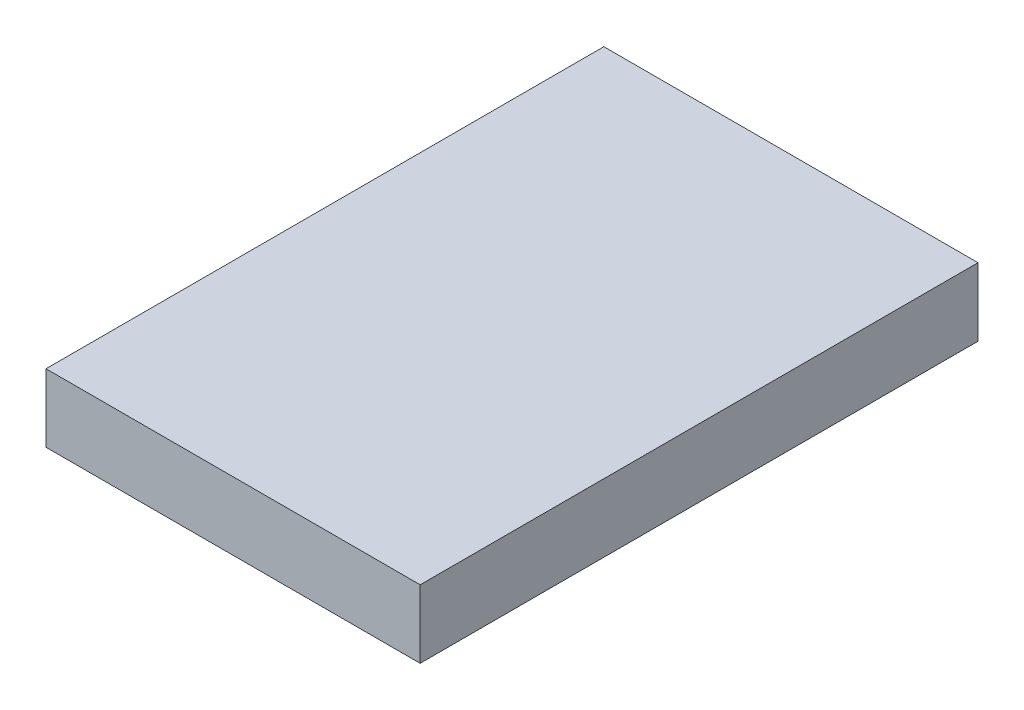
ISO-10303-21;
HEADER;
FILE_DESCRIPTION(('STEP AP214'),'2;1');
FILE_NAME('part.step','',(''),(''),'','','');
FILE_SCHEMA(('AUTOMOTIVE_DESIGN { 1 0 10303 214 1 1 1 1 }'));
ENDSEC;
DATA;
#1=APPLICATION_CONTEXT('core data for automotive mechanical design processes');
#2=APPLICATION_PROTOCOL_DEFINITION('international standard','automotive_design',2000,#1);
#3=PRODUCT_CONTEXT('',#1,'mechanical');
#4=PRODUCT('Part','Part','',(#3));
#5=PRODUCT_RELATED_PRODUCT_CATEGORY('part','',(#4));
#6=PRODUCT_DEFINITION_FORMATION('','',#4);
#7=PRODUCT_DEFINITION_CONTEXT('part definition',#1,'design');
#8=PRODUCT_DEFINITION('design','',#6,#7);
#9=PRODUCT_DEFINITION_SHAPE('','',#8);
#10=(LENGTH_UNIT() NAMED_UNIT(*) SI_UNIT(.MILLI.,.METRE.));
#11=(NAMED_UNIT(*) PLANE_ANGLE_UNIT() SI_UNIT($,.RADIAN.));
#12=(NAMED_UNIT(*) SI_UNIT($,.STERADIAN.) SOLID_ANGLE_UNIT());
#13=UNCERTAINTY_MEASURE_WITH_UNIT(LENGTH_MEASURE(1.E-05),#10,'distance_accuracy_value','');
#14=(GEOMETRIC_REPRESENTATION_CONTEXT(3) GLOBAL_UNCERTAINTY_ASSIGNED_CONTEXT((#13)) GLOBAL_UNIT_ASSIGNED_CONTEXT((#10,
#11,#12)) REPRESENTATION_CONTEXT('',''));
#15=CARTESIAN_POINT('',(0.,0.,0.));
#16=DIRECTION('',(0.,0.,1.));
#17=DIRECTION('',(1.,0.,0.));
#18=AXIS2_PLACEMENT_3D('',#15,#16,#17);
#19=CARTESIAN_POINT('',(27.5,10.,-41.));
#20=DIRECTION('',(-1.,0.,0.));
#21=DIRECTION('',(0.,0.,1.));
#22=AXIS2_PLACEMENT_3D('',#19,#20,#21);
#23=PLANE('',#22);
#24=DIRECTION('',(0.,0.,-1.));
#25=VECTOR('',#24,1.);
#26=CARTESIAN_POINT('',(27.5,0.,-41.));
#27=LINE('',#26,#25);
#28=CARTESIAN_POINT('',(27.5,0.,41.));
#29=VERTEX_POINT('',#28);
#30=CARTESIAN_POINT('',(27.5,0.,-41.));
#31=VERTEX_POINT('',#30);
#32=EDGE_CURVE('E95',#29,#31,#27,.T.);
#33=ORIENTED_EDGE('',*,*,#32,.T.);
#34=DIRECTION('',(0.,-1.,0.));
#35=VECTOR('',#34,1.);
#36=CARTESIAN_POINT('',(27.5,10.,-41.));
#37=LINE('',#36,#35);
#38=CARTESIAN_POINT('',(27.5,10.,-41.));
#39=VERTEX_POINT('',#38);
#40=EDGE_CURVE('E11',#39,#31,#37,.T.);
#41=ORIENTED_EDGE('',*,*,#40,.F.);
#42=DIRECTION('',(0.,0.,-1.));
#43=VECTOR('',#42,1.);
#44=CARTESIAN_POINT('',(27.5,10.,-41.));
#45=LINE('',#44,#43);
#46=CARTESIAN_POINT('',(27.5,10.,41.));
#47=VERTEX_POINT('',#46);
#48=EDGE_CURVE('E83',#47,#39,#45,.T.);
#49=ORIENTED_EDGE('',*,*,#48,.F.);
#50=DIRECTION('',(0.,-1.,0.));
#51=VECTOR('',#50,1.);
#52=CARTESIAN_POINT('',(27.5,10.,41.));
#53=LINE('',#52,#51);
#54=EDGE_CURVE('E91',#47,#29,#53,.T.);
#55=ORIENTED_EDGE('',*,*,#54,.T.);
#56=EDGE_LOOP('',(#33,#41,#49,#55));
#57=FACE_BOUND('',#56,.T.);
#58=ADVANCED_FACE('F32',(#57),#23,.F.);
#59=CARTESIAN_POINT('',(-27.5,10.,-41.));
#60=DIRECTION('',(0.,0.,1.));
#61=DIRECTION('',(1.,0.,0.));
#62=AXIS2_PLACEMENT_3D('',#59,#60,#61);
#63=PLANE('',#62);
#64=DIRECTION('',(-1.,0.,0.));
#65=VECTOR('',#64,1.);
#66=CARTESIAN_POINT('',(-27.5,0.,-41.));
#67=LINE('',#66,#65);
#68=CARTESIAN_POINT('',(-27.5,0.,-41.));
#69=VERTEX_POINT('',#68);
#70=EDGE_CURVE('E87',#31,#69,#67,.T.);
#71=ORIENTED_EDGE('',*,*,#70,.T.);
#72=DIRECTION('',(0.,-1.,0.));
#73=VECTOR('',#72,1.);
#74=CARTESIAN_POINT('',(-27.5,10.,-41.));
#75=LINE('',#74,#73);
#76=CARTESIAN_POINT('',(-27.5,10.,-41.));
#77=VERTEX_POINT('',#76);
#78=EDGE_CURVE('E40',#77,#69,#75,.T.);
#79=ORIENTED_EDGE('',*,*,#78,.F.);
#80=DIRECTION('',(-1.,0.,0.));
#81=VECTOR('',#80,1.);
#82=CARTESIAN_POINT('',(-27.5,10.,-41.));
#83=LINE('',#82,#81);
#84=EDGE_CURVE('E78',#39,#77,#83,.T.);
#85=ORIENTED_EDGE('',*,*,#84,.F.);
#86=ORIENTED_EDGE('',*,*,#40,.T.);
#87=EDGE_LOOP('',(#71,#79,#85,#86));
#88=FACE_BOUND('',#87,.T.);
#89=ADVANCED_FACE('F86',(#88),#63,.F.);
#90=CARTESIAN_POINT('',(-27.5,10.,-41.));
#91=DIRECTION('',(1.,0.,0.));
#92=DIRECTION('',(0.,0.,-1.));
#93=AXIS2_PLACEMENT_3D('',#90,#91,#92);
#94=PLANE('',#93);
#95=DIRECTION('',(0.,0.,1.));
#96=VECTOR('',#95,1.);
#97=CARTESIAN_POINT('',(-27.5,0.,-41.));
#98=LINE('',#97,#96);
#99=CARTESIAN_POINT('',(-27.5,0.,41.));
#100=VERTEX_POINT('',#99);
#101=EDGE_CURVE('E65',#69,#100,#98,.T.);
#102=ORIENTED_EDGE('',*,*,#101,.T.);
#103=DIRECTION('',(0.,-1.,0.));
#104=VECTOR('',#103,1.);
#105=CARTESIAN_POINT('',(-27.5,10.,41.));
#106=LINE('',#105,#104);
#107=CARTESIAN_POINT('',(-27.5,10.,41.));
#108=VERTEX_POINT('',#107);
#109=EDGE_CURVE('E88',#108,#100,#106,.T.);
#110=ORIENTED_EDGE('',*,*,#109,.F.);
#111=DIRECTION('',(0.,0.,1.));
#112=VECTOR('',#111,1.);
#113=CARTESIAN_POINT('',(-27.5,10.,-41.));
#114=LINE('',#113,#112);
#115=EDGE_CURVE('E81',#77,#108,#114,.T.);
#116=ORIENTED_EDGE('',*,*,#115,.F.);
#117=ORIENTED_EDGE('',*,*,#78,.T.);
#118=EDGE_LOOP('',(#102,#110,#116,#117));
#119=FACE_BOUND('',#118,.T.);
#120=ADVANCED_FACE('F89',(#119),#94,.F.);
#121=CARTESIAN_POINT('',(-27.5,10.,41.));
#122=DIRECTION('',(0.,0.,-1.));
#123=DIRECTION('',(-1.,0.,0.));
#124=AXIS2_PLACEMENT_3D('',#121,#122,#123);
#125=PLANE('',#124);
#126=DIRECTION('',(1.,0.,0.));
#127=VECTOR('',#126,1.);
#128=CARTESIAN_POINT('',(-27.5,0.,41.));
#129=LINE('',#128,#127);
#130=EDGE_CURVE('E71',#100,#29,#129,.T.);
#131=ORIENTED_EDGE('',*,*,#130,.T.);
#132=ORIENTED_EDGE('',*,*,#54,.F.);
#133=DIRECTION('',(1.,0.,0.));
#134=VECTOR('',#133,1.);
#135=CARTESIAN_POINT('',(-27.5,10.,41.));
#136=LINE('',#135,#134);
#137=EDGE_CURVE('E48',#108,#47,#136,.T.);
#138=ORIENTED_EDGE('',*,*,#137,.F.);
#139=ORIENTED_EDGE('',*,*,#109,.T.);
#140=EDGE_LOOP('',(#131,#132,#138,#139));
#141=FACE_BOUND('',#140,.T.);
#142=ADVANCED_FACE('F102',(#141),#125,.F.);
#143=CARTESIAN_POINT('',(27.5,10.,41.));
#144=DIRECTION('',(0.,1.,0.));
#145=DIRECTION('',(0.,0.,1.));
#146=AXIS2_PLACEMENT_3D('',#143,#144,#145);
#147=PLANE('',#146);
#148=ORIENTED_EDGE('',*,*,#48,.T.);
#149=ORIENTED_EDGE('',*,*,#84,.T.);
#150=ORIENTED_EDGE('',*,*,#115,.T.);
#151=ORIENTED_EDGE('',*,*,#137,.T.);
#152=EDGE_LOOP('',(#148,#149,#150,#151));
#153=FACE_BOUND('',#152,.T.);
#154=ADVANCED_FACE('F79',(#153),#147,.T.);
#155=CARTESIAN_POINT('',(27.5,0.,41.));
#156=DIRECTION('',(0.,1.,0.));
#157=DIRECTION('',(0.,0.,1.));
#158=AXIS2_PLACEMENT_3D('',#155,#156,#157);
#159=PLANE('',#158);
#160=ORIENTED_EDGE('',*,*,#32,.F.);
#161=ORIENTED_EDGE('',*,*,#130,.F.);
#162=ORIENTED_EDGE('',*,*,#101,.F.);
#163=ORIENTED_EDGE('',*,*,#70,.F.);
#164=EDGE_LOOP('',(#160,#161,#162,#163));
#165=FACE_BOUND('',#164,.T.);
#166=ADVANCED_FACE('F105',(#165),#159,.F.);
#167=CLOSED_SHELL('',(#58,#89,#120,#142,#154,#166));
#168=MANIFOLD_SOLID_BREP('B2',#167);
#169=ADVANCED_BREP_SHAPE_REPRESENTATION('',(#18,#168),#14);
#170=SHAPE_DEFINITION_REPRESENTATION(#9,#169);
ENDSEC;
END-ISO-10303-21;
